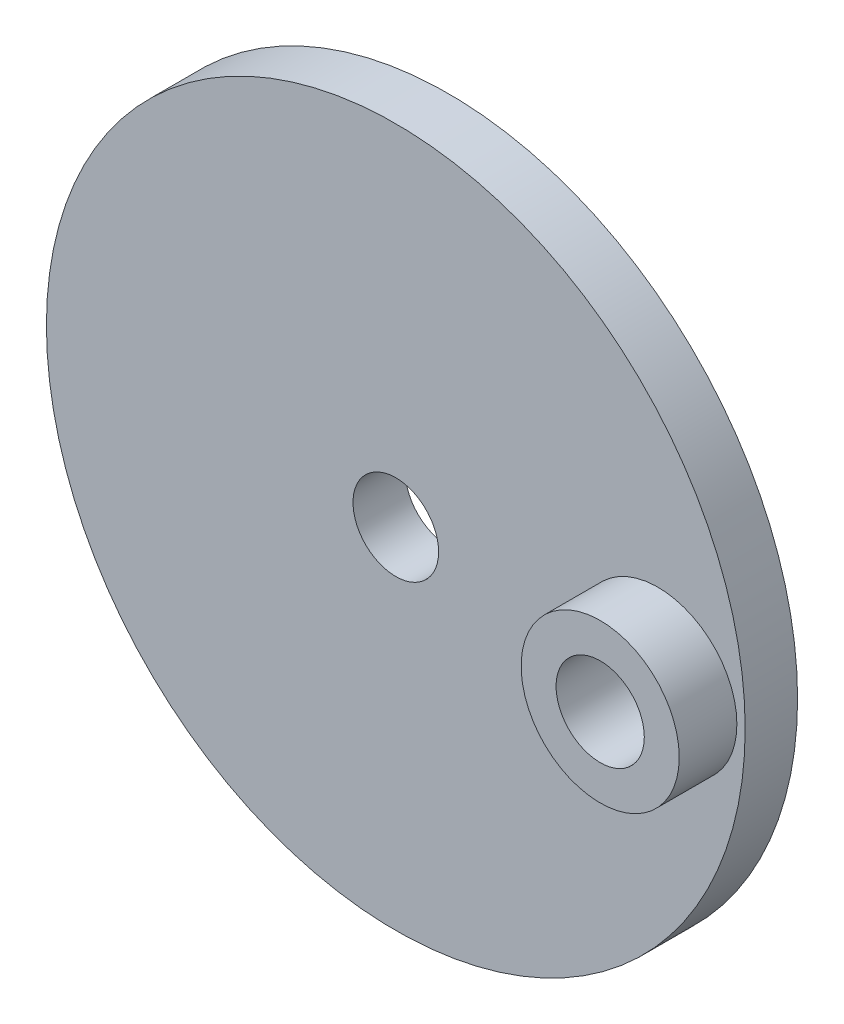
ISO-10303-21;
HEADER;
FILE_DESCRIPTION(('STEP AP214'),'2;1');
FILE_NAME('part.step','',(''),(''),'','','');
FILE_SCHEMA(('AUTOMOTIVE_DESIGN { 1 0 10303 214 1 1 1 1 }'));
ENDSEC;
DATA;
#1=APPLICATION_CONTEXT('core data for automotive mechanical design processes');
#2=APPLICATION_PROTOCOL_DEFINITION('international standard','automotive_design',2000,#1);
#3=PRODUCT_CONTEXT('',#1,'mechanical');
#4=PRODUCT('Part','Part','',(#3));
#5=PRODUCT_RELATED_PRODUCT_CATEGORY('part','',(#4));
#6=PRODUCT_DEFINITION_FORMATION('','',#4);
#7=PRODUCT_DEFINITION_CONTEXT('part definition',#1,'design');
#8=PRODUCT_DEFINITION('design','',#6,#7);
#9=PRODUCT_DEFINITION_SHAPE('','',#8);
#10=(LENGTH_UNIT() NAMED_UNIT(*) SI_UNIT(.MILLI.,.METRE.));
#11=(NAMED_UNIT(*) PLANE_ANGLE_UNIT() SI_UNIT($,.RADIAN.));
#12=(NAMED_UNIT(*) SI_UNIT($,.STERADIAN.) SOLID_ANGLE_UNIT());
#13=UNCERTAINTY_MEASURE_WITH_UNIT(LENGTH_MEASURE(1.E-05),#10,'distance_accuracy_value','');
#14=(GEOMETRIC_REPRESENTATION_CONTEXT(3) GLOBAL_UNCERTAINTY_ASSIGNED_CONTEXT((#13)) GLOBAL_UNIT_ASSIGNED_CONTEXT((#10,
#11,#12)) REPRESENTATION_CONTEXT('',''));
#15=CARTESIAN_POINT('',(0.,0.,0.));
#16=DIRECTION('',(0.,0.,1.));
#17=DIRECTION('',(1.,0.,0.));
#18=AXIS2_PLACEMENT_3D('',#15,#16,#17);
#19=CARTESIAN_POINT('',(0.,0.,3.));
#20=DIRECTION('',(0.,0.,1.));
#21=DIRECTION('',(1.,0.,0.));
#22=AXIS2_PLACEMENT_3D('',#19,#20,#21);
#23=PLANE('',#22);
#24=CARTESIAN_POINT('',(0.,0.,3.));
#25=DIRECTION('',(0.,0.,1.));
#26=DIRECTION('',(1.,0.,0.));
#27=AXIS2_PLACEMENT_3D('',#24,#25,#26);
#28=CIRCLE('',#27,2.45);
#29=CARTESIAN_POINT('',(2.45,0.,3.));
#30=VERTEX_POINT('',#29);
#31=EDGE_CURVE('E71',#30,#30,#28,.F.);
#32=ORIENTED_EDGE('',*,*,#31,.T.);
#33=EDGE_LOOP('',(#32));
#34=FACE_BOUND('',#33,.T.);
#35=CARTESIAN_POINT('',(0.,0.,3.));
#36=DIRECTION('',(0.,0.,1.));
#37=DIRECTION('',(1.,0.,0.));
#38=AXIS2_PLACEMENT_3D('',#35,#36,#37);
#39=CIRCLE('',#38,20.);
#40=CARTESIAN_POINT('',(20.,0.,3.));
#41=VERTEX_POINT('',#40);
#42=EDGE_CURVE('E10',#41,#41,#39,.T.);
#43=ORIENTED_EDGE('',*,*,#42,.T.);
#44=EDGE_LOOP('',(#43));
#45=FACE_BOUND('',#44,.T.);
#46=CARTESIAN_POINT('',(15.,0.,3.));
#47=DIRECTION('',(0.,0.,1.));
#48=DIRECTION('',(1.,0.,0.));
#49=AXIS2_PLACEMENT_3D('',#46,#47,#48);
#50=CIRCLE('',#49,4.525);
#51=CARTESIAN_POINT('',(19.525,0.,3.));
#52=VERTEX_POINT('',#51);
#53=EDGE_CURVE('E60',#52,#52,#50,.T.);
#54=ORIENTED_EDGE('',*,*,#53,.F.);
#55=EDGE_LOOP('',(#54));
#56=FACE_BOUND('',#55,.T.);
#57=ADVANCED_FACE('F41',(#34,#45,#56),#23,.T.);
#58=CARTESIAN_POINT('',(0.,0.,3.));
#59=DIRECTION('',(0.,0.,-1.));
#60=DIRECTION('',(-1.,0.,0.));
#61=AXIS2_PLACEMENT_3D('',#58,#59,#60);
#62=CYLINDRICAL_SURFACE('',#61,20.);
#63=ORIENTED_EDGE('',*,*,#42,.F.);
#64=EDGE_LOOP('',(#63));
#65=FACE_BOUND('',#64,.T.);
#66=CARTESIAN_POINT('',(0.,0.,0.));
#67=DIRECTION('',(0.,0.,1.));
#68=DIRECTION('',(1.,0.,0.));
#69=AXIS2_PLACEMENT_3D('',#66,#67,#68);
#70=CIRCLE('',#69,20.);
#71=CARTESIAN_POINT('',(20.,0.,0.));
#72=VERTEX_POINT('',#71);
#73=EDGE_CURVE('E45',#72,#72,#70,.T.);
#74=ORIENTED_EDGE('',*,*,#73,.T.);
#75=EDGE_LOOP('',(#74));
#76=FACE_BOUND('',#75,.T.);
#77=ADVANCED_FACE('F43',(#65,#76),#62,.T.);
#78=CARTESIAN_POINT('',(0.,0.,0.));
#79=DIRECTION('',(0.,0.,1.));
#80=DIRECTION('',(1.,0.,0.));
#81=AXIS2_PLACEMENT_3D('',#78,#79,#80);
#82=PLANE('',#81);
#83=CARTESIAN_POINT('',(0.,0.,0.));
#84=DIRECTION('',(0.,0.,1.));
#85=DIRECTION('',(1.,0.,0.));
#86=AXIS2_PLACEMENT_3D('',#83,#84,#85);
#87=CIRCLE('',#86,2.45);
#88=CARTESIAN_POINT('',(2.45,0.,0.));
#89=VERTEX_POINT('',#88);
#90=EDGE_CURVE('E75',#89,#89,#87,.T.);
#91=ORIENTED_EDGE('',*,*,#90,.T.);
#92=EDGE_LOOP('',(#91));
#93=FACE_BOUND('',#92,.T.);
#94=CARTESIAN_POINT('',(15.,0.,0.));
#95=DIRECTION('',(0.,0.,1.));
#96=DIRECTION('',(1.,0.,0.));
#97=AXIS2_PLACEMENT_3D('',#94,#95,#96);
#98=CIRCLE('',#97,2.525);
#99=CARTESIAN_POINT('',(17.525,0.,0.));
#100=VERTEX_POINT('',#99);
#101=EDGE_CURVE('E54',#100,#100,#98,.T.);
#102=ORIENTED_EDGE('',*,*,#101,.T.);
#103=EDGE_LOOP('',(#102));
#104=FACE_BOUND('',#103,.T.);
#105=ORIENTED_EDGE('',*,*,#73,.F.);
#106=EDGE_LOOP('',(#105));
#107=FACE_BOUND('',#106,.T.);
#108=ADVANCED_FACE('F80',(#93,#104,#107),#82,.F.);
#109=CARTESIAN_POINT('',(15.,0.,0.));
#110=DIRECTION('',(0.,0.,1.));
#111=DIRECTION('',(1.,0.,0.));
#112=AXIS2_PLACEMENT_3D('',#109,#110,#111);
#113=CYLINDRICAL_SURFACE('',#112,2.525);
#114=ORIENTED_EDGE('',*,*,#101,.F.);
#115=EDGE_LOOP('',(#114));
#116=FACE_BOUND('',#115,.T.);
#117=CARTESIAN_POINT('',(15.,0.,6.3));
#118=DIRECTION('',(0.,0.,1.));
#119=DIRECTION('',(1.,0.,0.));
#120=AXIS2_PLACEMENT_3D('',#117,#118,#119);
#121=CIRCLE('',#120,2.525);
#122=CARTESIAN_POINT('',(17.525,0.,6.3));
#123=VERTEX_POINT('',#122);
#124=EDGE_CURVE('E64',#123,#123,#121,.T.);
#125=ORIENTED_EDGE('',*,*,#124,.T.);
#126=EDGE_LOOP('',(#125));
#127=FACE_BOUND('',#126,.T.);
#128=ADVANCED_FACE('F104',(#116,#127),#113,.F.);
#129=CARTESIAN_POINT('',(15.,0.,6.3));
#130=DIRECTION('',(0.,0.,1.));
#131=DIRECTION('',(1.,0.,0.));
#132=AXIS2_PLACEMENT_3D('',#129,#130,#131);
#133=PLANE('',#132);
#134=CARTESIAN_POINT('',(15.,0.,6.3));
#135=DIRECTION('',(0.,0.,1.));
#136=DIRECTION('',(1.,0.,0.));
#137=AXIS2_PLACEMENT_3D('',#134,#135,#136);
#138=CIRCLE('',#137,4.525);
#139=CARTESIAN_POINT('',(19.525,0.,6.3));
#140=VERTEX_POINT('',#139);
#141=EDGE_CURVE('E59',#140,#140,#138,.T.);
#142=ORIENTED_EDGE('',*,*,#141,.T.);
#143=EDGE_LOOP('',(#142));
#144=FACE_BOUND('',#143,.T.);
#145=ORIENTED_EDGE('',*,*,#124,.F.);
#146=EDGE_LOOP('',(#145));
#147=FACE_BOUND('',#146,.T.);
#148=ADVANCED_FACE('F91',(#144,#147),#133,.T.);
#149=CARTESIAN_POINT('',(15.,0.,6.3));
#150=DIRECTION('',(0.,0.,-1.));
#151=DIRECTION('',(-1.,0.,0.));
#152=AXIS2_PLACEMENT_3D('',#149,#150,#151);
#153=CYLINDRICAL_SURFACE('',#152,4.525);
#154=ORIENTED_EDGE('',*,*,#141,.F.);
#155=EDGE_LOOP('',(#154));
#156=FACE_BOUND('',#155,.T.);
#157=ORIENTED_EDGE('',*,*,#53,.T.);
#158=EDGE_LOOP('',(#157));
#159=FACE_BOUND('',#158,.T.);
#160=ADVANCED_FACE('F85',(#156,#159),#153,.T.);
#161=CARTESIAN_POINT('',(0.,0.,6.3));
#162=DIRECTION('',(0.,0.,-1.));
#163=DIRECTION('',(-1.,0.,0.));
#164=AXIS2_PLACEMENT_3D('',#161,#162,#163);
#165=CYLINDRICAL_SURFACE('',#164,2.45);
#166=ORIENTED_EDGE('',*,*,#31,.F.);
#167=EDGE_LOOP('',(#166));
#168=FACE_BOUND('',#167,.T.);
#169=ORIENTED_EDGE('',*,*,#90,.F.);
#170=EDGE_LOOP('',(#169));
#171=FACE_BOUND('',#170,.T.);
#172=ADVANCED_FACE('F83',(#168,#171),#165,.F.);
#173=CLOSED_SHELL('',(#57,#77,#108,#128,#148,#160,#172));
#174=MANIFOLD_SOLID_BREP('B2',#173);
#175=ADVANCED_BREP_SHAPE_REPRESENTATION('',(#18,#174),#14);
#176=SHAPE_DEFINITION_REPRESENTATION(#9,#175);
ENDSEC;
END-ISO-10303-21;
